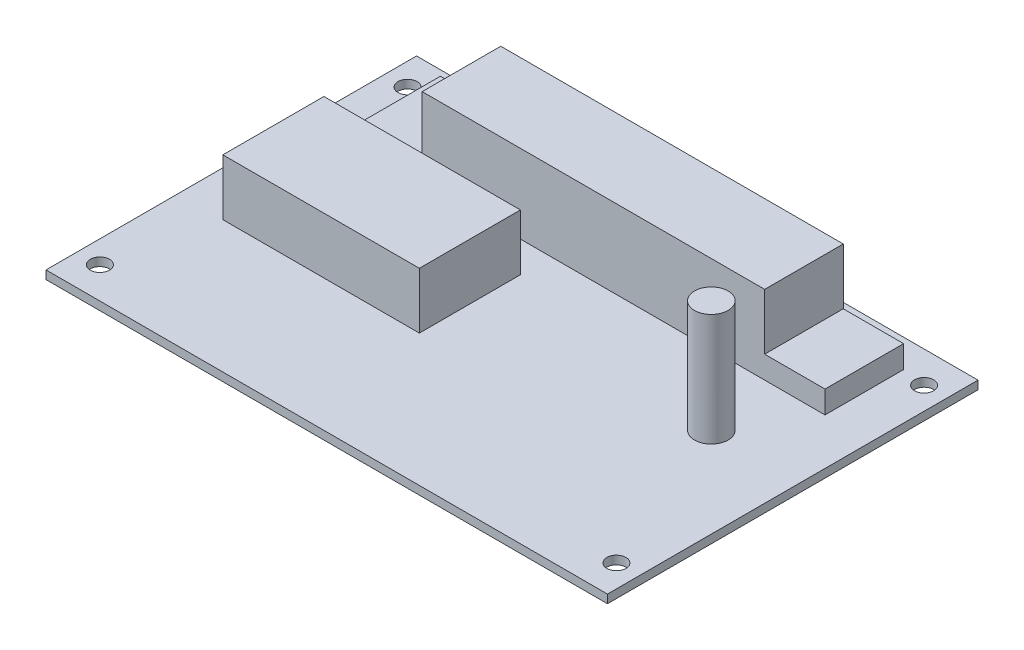
ISO-10303-21;
HEADER;
FILE_DESCRIPTION(('STEP AP214'),'2;1');
FILE_NAME('part.step','',(''),(''),'','','');
FILE_SCHEMA(('AUTOMOTIVE_DESIGN { 1 0 10303 214 1 1 1 1 }'));
ENDSEC;
DATA;
#1=APPLICATION_CONTEXT('core data for automotive mechanical design processes');
#2=APPLICATION_PROTOCOL_DEFINITION('international standard','automotive_design',2000,#1);
#3=PRODUCT_CONTEXT('',#1,'mechanical');
#4=PRODUCT('Part','Part','',(#3));
#5=PRODUCT_RELATED_PRODUCT_CATEGORY('part','',(#4));
#6=PRODUCT_DEFINITION_FORMATION('','',#4);
#7=PRODUCT_DEFINITION_CONTEXT('part definition',#1,'design');
#8=PRODUCT_DEFINITION('design','',#6,#7);
#9=PRODUCT_DEFINITION_SHAPE('','',#8);
#10=(LENGTH_UNIT() NAMED_UNIT(*) SI_UNIT(.MILLI.,.METRE.));
#11=(NAMED_UNIT(*) PLANE_ANGLE_UNIT() SI_UNIT($,.RADIAN.));
#12=(NAMED_UNIT(*) SI_UNIT($,.STERADIAN.) SOLID_ANGLE_UNIT());
#13=UNCERTAINTY_MEASURE_WITH_UNIT(LENGTH_MEASURE(1.E-05),#10,'distance_accuracy_value','');
#14=(GEOMETRIC_REPRESENTATION_CONTEXT(3) GLOBAL_UNCERTAINTY_ASSIGNED_CONTEXT((#13)) GLOBAL_UNIT_ASSIGNED_CONTEXT((#10,
#11,#12)) REPRESENTATION_CONTEXT('',''));
#15=CARTESIAN_POINT('',(0.,0.,0.));
#16=DIRECTION('',(0.,0.,1.));
#17=DIRECTION('',(1.,0.,0.));
#18=AXIS2_PLACEMENT_3D('',#15,#16,#17);
#19=CARTESIAN_POINT('',(0.,1.5,0.));
#20=DIRECTION('',(0.,-1.,0.));
#21=DIRECTION('',(0.,0.,-1.));
#22=AXIS2_PLACEMENT_3D('',#19,#20,#21);
#23=PLANE('',#22);
#24=DIRECTION('',(0.,0.,-1.));
#25=VECTOR('',#24,1.);
#26=CARTESIAN_POINT('',(41.75,1.5,-28.));
#27=LINE('',#26,#25);
#28=CARTESIAN_POINT('',(41.75,1.5,-14.));
#29=VERTEX_POINT('',#28);
#30=CARTESIAN_POINT('',(41.75,1.5,-28.));
#31=VERTEX_POINT('',#30);
#32=EDGE_CURVE('E221',#29,#31,#27,.T.);
#33=ORIENTED_EDGE('',*,*,#32,.F.);
#34=DIRECTION('',(1.,0.,0.));
#35=VECTOR('',#34,1.);
#36=CARTESIAN_POINT('',(-30.,1.5,-14.));
#37=LINE('',#36,#35);
#38=CARTESIAN_POINT('',(-40.75,1.5,-14.));
#39=VERTEX_POINT('',#38);
#40=EDGE_CURVE('E251',#39,#29,#37,.T.);
#41=ORIENTED_EDGE('',*,*,#40,.F.);
#42=DIRECTION('',(0.,0.,1.));
#43=VECTOR('',#42,1.);
#44=CARTESIAN_POINT('',(-40.75,1.5,-28.));
#45=LINE('',#44,#43);
#46=CARTESIAN_POINT('',(-40.75,1.5,-28.));
#47=VERTEX_POINT('',#46);
#48=EDGE_CURVE('E216',#47,#39,#45,.T.);
#49=ORIENTED_EDGE('',*,*,#48,.F.);
#50=DIRECTION('',(-1.,0.,0.));
#51=VECTOR('',#50,1.);
#52=CARTESIAN_POINT('',(-30.,1.5,-28.));
#53=LINE('',#52,#51);
#54=EDGE_CURVE('E257',#31,#47,#53,.T.);
#55=ORIENTED_EDGE('',*,*,#54,.F.);
#56=EDGE_LOOP('',(#33,#41,#49,#55));
#57=FACE_BOUND('',#56,.T.);
#58=DIRECTION('',(0.,0.,-1.));
#59=VECTOR('',#58,1.);
#60=CARTESIAN_POINT('',(50.,1.5,33.));
#61=LINE('',#60,#59);
#62=CARTESIAN_POINT('',(50.,1.5,33.));
#63=VERTEX_POINT('',#62);
#64=CARTESIAN_POINT('',(50.,1.5,-33.));
#65=VERTEX_POINT('',#64);
#66=EDGE_CURVE('E281',#63,#65,#61,.T.);
#67=ORIENTED_EDGE('',*,*,#66,.T.);
#68=DIRECTION('',(-1.,0.,0.));
#69=VECTOR('',#68,1.);
#70=CARTESIAN_POINT('',(-50.,1.5,-33.));
#71=LINE('',#70,#69);
#72=CARTESIAN_POINT('',(-50.,1.5,-33.));
#73=VERTEX_POINT('',#72);
#74=EDGE_CURVE('E285',#65,#73,#71,.T.);
#75=ORIENTED_EDGE('',*,*,#74,.T.);
#76=DIRECTION('',(0.,0.,1.));
#77=VECTOR('',#76,1.);
#78=CARTESIAN_POINT('',(-50.,1.5,33.));
#79=LINE('',#78,#77);
#80=CARTESIAN_POINT('',(-50.,1.5,33.));
#81=VERTEX_POINT('',#80);
#82=EDGE_CURVE('E289',#73,#81,#79,.T.);
#83=ORIENTED_EDGE('',*,*,#82,.T.);
#84=DIRECTION('',(1.,0.,0.));
#85=VECTOR('',#84,1.);
#86=CARTESIAN_POINT('',(-50.,1.5,33.));
#87=LINE('',#86,#85);
#88=EDGE_CURVE('E291',#81,#63,#87,.T.);
#89=ORIENTED_EDGE('',*,*,#88,.T.);
#90=EDGE_LOOP('',(#67,#75,#83,#89));
#91=FACE_BOUND('',#90,.T.);
#92=CARTESIAN_POINT('',(34.,1.5,-1.49999999999999));
#93=DIRECTION('',(0.,-1.,0.));
#94=DIRECTION('',(0.,0.,-1.));
#95=AXIS2_PLACEMENT_3D('',#92,#93,#94);
#96=CIRCLE('',#95,3.);
#97=CARTESIAN_POINT('',(34.,1.5,-4.5));
#98=VERTEX_POINT('',#97);
#99=EDGE_CURVE('E12',#98,#98,#96,.F.);
#100=ORIENTED_EDGE('',*,*,#99,.F.);
#101=EDGE_LOOP('',(#100));
#102=FACE_BOUND('',#101,.T.);
#103=CARTESIAN_POINT('',(46.,1.5,27.4007764277433));
#104=DIRECTION('',(0.,1.,0.));
#105=DIRECTION('',(0.,0.,1.));
#106=AXIS2_PLACEMENT_3D('',#103,#104,#105);
#107=CIRCLE('',#106,1.7);
#108=CARTESIAN_POINT('',(46.,1.5,29.1007764277433));
#109=VERTEX_POINT('',#108);
#110=EDGE_CURVE('E206',#109,#109,#107,.T.);
#111=ORIENTED_EDGE('',*,*,#110,.F.);
#112=EDGE_LOOP('',(#111));
#113=FACE_BOUND('',#112,.T.);
#114=CARTESIAN_POINT('',(46.,1.5,-27.4007764277433));
#115=DIRECTION('',(0.,1.,0.));
#116=DIRECTION('',(0.,0.,1.));
#117=AXIS2_PLACEMENT_3D('',#114,#115,#116);
#118=CIRCLE('',#117,1.7);
#119=CARTESIAN_POINT('',(46.,1.5,-25.7007764277433));
#120=VERTEX_POINT('',#119);
#121=EDGE_CURVE('E200',#120,#120,#118,.T.);
#122=ORIENTED_EDGE('',*,*,#121,.F.);
#123=EDGE_LOOP('',(#122));
#124=FACE_BOUND('',#123,.T.);
#125=CARTESIAN_POINT('',(-46.,1.5,-27.4007764277433));
#126=DIRECTION('',(0.,1.,0.));
#127=DIRECTION('',(0.,0.,1.));
#128=AXIS2_PLACEMENT_3D('',#125,#126,#127);
#129=CIRCLE('',#128,1.7);
#130=CARTESIAN_POINT('',(-46.,1.5,-25.7007764277433));
#131=VERTEX_POINT('',#130);
#132=EDGE_CURVE('E194',#131,#131,#129,.T.);
#133=ORIENTED_EDGE('',*,*,#132,.F.);
#134=EDGE_LOOP('',(#133));
#135=FACE_BOUND('',#134,.T.);
#136=CARTESIAN_POINT('',(-46.,1.5,27.4007764277433));
#137=DIRECTION('',(0.,1.,0.));
#138=DIRECTION('',(0.,0.,1.));
#139=AXIS2_PLACEMENT_3D('',#136,#137,#138);
#140=CIRCLE('',#139,1.7);
#141=CARTESIAN_POINT('',(-46.,1.5,29.1007764277433));
#142=VERTEX_POINT('',#141);
#143=EDGE_CURVE('E183',#142,#142,#140,.T.);
#144=ORIENTED_EDGE('',*,*,#143,.F.);
#145=EDGE_LOOP('',(#144));
#146=FACE_BOUND('',#145,.T.);
#147=DIRECTION('',(0.,0.,1.));
#148=VECTOR('',#147,1.);
#149=CARTESIAN_POINT('',(-42.,1.5,-8.49999999999999));
#150=LINE('',#149,#148);
#151=CARTESIAN_POINT('',(-42.,1.5,-8.49999999999999));
#152=VERTEX_POINT('',#151);
#153=CARTESIAN_POINT('',(-42.,1.5,9.50000000000001));
#154=VERTEX_POINT('',#153);
#155=EDGE_CURVE('E182',#152,#154,#150,.T.);
#156=ORIENTED_EDGE('',*,*,#155,.F.);
#157=DIRECTION('',(-1.,0.,0.));
#158=VECTOR('',#157,1.);
#159=CARTESIAN_POINT('',(-42.,1.5,-8.49999999999999));
#160=LINE('',#159,#158);
#161=CARTESIAN_POINT('',(-7.00000000000001,1.5,-8.49999999999999));
#162=VERTEX_POINT('',#161);
#163=EDGE_CURVE('E179',#162,#152,#160,.T.);
#164=ORIENTED_EDGE('',*,*,#163,.F.);
#165=DIRECTION('',(0.,0.,-1.));
#166=VECTOR('',#165,1.);
#167=CARTESIAN_POINT('',(-7.00000000000001,1.5,-8.49999999999999));
#168=LINE('',#167,#166);
#169=CARTESIAN_POINT('',(-7.00000000000001,1.5,9.50000000000001));
#170=VERTEX_POINT('',#169);
#171=EDGE_CURVE('E66',#170,#162,#168,.T.);
#172=ORIENTED_EDGE('',*,*,#171,.F.);
#173=DIRECTION('',(1.,0.,0.));
#174=VECTOR('',#173,1.);
#175=CARTESIAN_POINT('',(-42.,1.5,9.50000000000001));
#176=LINE('',#175,#174);
#177=EDGE_CURVE('E61',#154,#170,#176,.T.);
#178=ORIENTED_EDGE('',*,*,#177,.F.);
#179=EDGE_LOOP('',(#156,#164,#172,#178));
#180=FACE_BOUND('',#179,.T.);
#181=ADVANCED_FACE('F45',(#57,#91,#102,#113,#124,#135,#146,#180),#23,.F.);
#182=CARTESIAN_POINT('',(50.,1.5,33.));
#183=DIRECTION('',(-1.,0.,0.));
#184=DIRECTION('',(0.,0.,1.));
#185=AXIS2_PLACEMENT_3D('',#182,#183,#184);
#186=PLANE('',#185);
#187=DIRECTION('',(0.,0.,-1.));
#188=VECTOR('',#187,1.);
#189=CARTESIAN_POINT('',(50.,0.,33.));
#190=LINE('',#189,#188);
#191=CARTESIAN_POINT('',(50.,0.,33.));
#192=VERTEX_POINT('',#191);
#193=CARTESIAN_POINT('',(50.,0.,-33.));
#194=VERTEX_POINT('',#193);
#195=EDGE_CURVE('E280',#192,#194,#190,.T.);
#196=ORIENTED_EDGE('',*,*,#195,.T.);
#197=DIRECTION('',(0.,-1.,0.));
#198=VECTOR('',#197,1.);
#199=CARTESIAN_POINT('',(50.,1.5,-33.));
#200=LINE('',#199,#198);
#201=EDGE_CURVE('E54',#65,#194,#200,.T.);
#202=ORIENTED_EDGE('',*,*,#201,.F.);
#203=ORIENTED_EDGE('',*,*,#66,.F.);
#204=DIRECTION('',(0.,-1.,0.));
#205=VECTOR('',#204,1.);
#206=CARTESIAN_POINT('',(50.,1.5,33.));
#207=LINE('',#206,#205);
#208=EDGE_CURVE('E293',#63,#192,#207,.T.);
#209=ORIENTED_EDGE('',*,*,#208,.T.);
#210=EDGE_LOOP('',(#196,#202,#203,#209));
#211=FACE_BOUND('',#210,.T.);
#212=ADVANCED_FACE('F47',(#211),#186,.F.);
#213=CARTESIAN_POINT('',(-50.,1.5,-33.));
#214=DIRECTION('',(0.,0.,1.));
#215=DIRECTION('',(1.,0.,0.));
#216=AXIS2_PLACEMENT_3D('',#213,#214,#215);
#217=PLANE('',#216);
#218=DIRECTION('',(-1.,0.,0.));
#219=VECTOR('',#218,1.);
#220=CARTESIAN_POINT('',(-50.,0.,-33.));
#221=LINE('',#220,#219);
#222=CARTESIAN_POINT('',(-50.,0.,-33.));
#223=VERTEX_POINT('',#222);
#224=EDGE_CURVE('E297',#194,#223,#221,.T.);
#225=ORIENTED_EDGE('',*,*,#224,.T.);
#226=DIRECTION('',(0.,-1.,0.));
#227=VECTOR('',#226,1.);
#228=CARTESIAN_POINT('',(-50.,1.5,-33.));
#229=LINE('',#228,#227);
#230=EDGE_CURVE('E308',#73,#223,#229,.T.);
#231=ORIENTED_EDGE('',*,*,#230,.F.);
#232=ORIENTED_EDGE('',*,*,#74,.F.);
#233=ORIENTED_EDGE('',*,*,#201,.T.);
#234=EDGE_LOOP('',(#225,#231,#232,#233));
#235=FACE_BOUND('',#234,.T.);
#236=ADVANCED_FACE('F313',(#235),#217,.F.);
#237=CARTESIAN_POINT('',(-50.,1.5,33.));
#238=DIRECTION('',(1.,0.,0.));
#239=DIRECTION('',(0.,0.,-1.));
#240=AXIS2_PLACEMENT_3D('',#237,#238,#239);
#241=PLANE('',#240);
#242=DIRECTION('',(0.,0.,1.));
#243=VECTOR('',#242,1.);
#244=CARTESIAN_POINT('',(-50.,0.,33.));
#245=LINE('',#244,#243);
#246=CARTESIAN_POINT('',(-50.,0.,33.));
#247=VERTEX_POINT('',#246);
#248=EDGE_CURVE('E300',#223,#247,#245,.T.);
#249=ORIENTED_EDGE('',*,*,#248,.T.);
#250=DIRECTION('',(0.,-1.,0.));
#251=VECTOR('',#250,1.);
#252=CARTESIAN_POINT('',(-50.,1.5,33.));
#253=LINE('',#252,#251);
#254=EDGE_CURVE('E305',#81,#247,#253,.T.);
#255=ORIENTED_EDGE('',*,*,#254,.F.);
#256=ORIENTED_EDGE('',*,*,#82,.F.);
#257=ORIENTED_EDGE('',*,*,#230,.T.);
#258=EDGE_LOOP('',(#249,#255,#256,#257));
#259=FACE_BOUND('',#258,.T.);
#260=ADVANCED_FACE('F325',(#259),#241,.F.);
#261=CARTESIAN_POINT('',(-50.,1.5,33.));
#262=DIRECTION('',(0.,0.,-1.));
#263=DIRECTION('',(-1.,0.,0.));
#264=AXIS2_PLACEMENT_3D('',#261,#262,#263);
#265=PLANE('',#264);
#266=DIRECTION('',(1.,0.,0.));
#267=VECTOR('',#266,1.);
#268=CARTESIAN_POINT('',(-50.,0.,33.));
#269=LINE('',#268,#267);
#270=EDGE_CURVE('E286',#247,#192,#269,.T.);
#271=ORIENTED_EDGE('',*,*,#270,.T.);
#272=ORIENTED_EDGE('',*,*,#208,.F.);
#273=ORIENTED_EDGE('',*,*,#88,.F.);
#274=ORIENTED_EDGE('',*,*,#254,.T.);
#275=EDGE_LOOP('',(#271,#272,#273,#274));
#276=FACE_BOUND('',#275,.T.);
#277=ADVANCED_FACE('F329',(#276),#265,.F.);
#278=CARTESIAN_POINT('',(0.,0.,0.));
#279=DIRECTION('',(0.,-1.,0.));
#280=DIRECTION('',(0.,0.,-1.));
#281=AXIS2_PLACEMENT_3D('',#278,#279,#280);
#282=PLANE('',#281);
#283=CARTESIAN_POINT('',(-46.,0.,27.4007764277433));
#284=DIRECTION('',(0.,1.,0.));
#285=DIRECTION('',(0.,0.,1.));
#286=AXIS2_PLACEMENT_3D('',#283,#284,#285);
#287=CIRCLE('',#286,1.7);
#288=CARTESIAN_POINT('',(-46.,0.,29.1007764277433));
#289=VERTEX_POINT('',#288);
#290=EDGE_CURVE('E186',#289,#289,#287,.T.);
#291=ORIENTED_EDGE('',*,*,#290,.T.);
#292=EDGE_LOOP('',(#291));
#293=FACE_BOUND('',#292,.T.);
#294=CARTESIAN_POINT('',(-46.,0.,-27.4007764277433));
#295=DIRECTION('',(0.,1.,0.));
#296=DIRECTION('',(0.,0.,1.));
#297=AXIS2_PLACEMENT_3D('',#294,#295,#296);
#298=CIRCLE('',#297,1.7);
#299=CARTESIAN_POINT('',(-46.,0.,-25.7007764277433));
#300=VERTEX_POINT('',#299);
#301=EDGE_CURVE('E197',#300,#300,#298,.T.);
#302=ORIENTED_EDGE('',*,*,#301,.T.);
#303=EDGE_LOOP('',(#302));
#304=FACE_BOUND('',#303,.T.);
#305=CARTESIAN_POINT('',(46.,0.,-27.4007764277433));
#306=DIRECTION('',(0.,1.,0.));
#307=DIRECTION('',(0.,0.,1.));
#308=AXIS2_PLACEMENT_3D('',#305,#306,#307);
#309=CIRCLE('',#308,1.7);
#310=CARTESIAN_POINT('',(46.,0.,-25.7007764277433));
#311=VERTEX_POINT('',#310);
#312=EDGE_CURVE('E203',#311,#311,#309,.T.);
#313=ORIENTED_EDGE('',*,*,#312,.T.);
#314=EDGE_LOOP('',(#313));
#315=FACE_BOUND('',#314,.T.);
#316=CARTESIAN_POINT('',(46.,0.,27.4007764277433));
#317=DIRECTION('',(0.,1.,0.));
#318=DIRECTION('',(0.,0.,1.));
#319=AXIS2_PLACEMENT_3D('',#316,#317,#318);
#320=CIRCLE('',#319,1.7);
#321=CARTESIAN_POINT('',(46.,0.,29.1007764277433));
#322=VERTEX_POINT('',#321);
#323=EDGE_CURVE('E209',#322,#322,#320,.T.);
#324=ORIENTED_EDGE('',*,*,#323,.T.);
#325=EDGE_LOOP('',(#324));
#326=FACE_BOUND('',#325,.T.);
#327=ORIENTED_EDGE('',*,*,#195,.F.);
#328=ORIENTED_EDGE('',*,*,#270,.F.);
#329=ORIENTED_EDGE('',*,*,#248,.F.);
#330=ORIENTED_EDGE('',*,*,#224,.F.);
#331=EDGE_LOOP('',(#327,#328,#329,#330));
#332=FACE_BOUND('',#331,.T.);
#333=ADVANCED_FACE('F321',(#293,#304,#315,#326,#332),#282,.T.);
#334=CARTESIAN_POINT('',(-30.,15.5,-28.));
#335=DIRECTION('',(1.,0.,0.));
#336=DIRECTION('',(0.,0.,-1.));
#337=AXIS2_PLACEMENT_3D('',#334,#335,#336);
#338=PLANE('',#337);
#339=DIRECTION('',(0.,-1.,0.));
#340=VECTOR('',#339,1.);
#341=CARTESIAN_POINT('',(-30.,15.5,-28.));
#342=LINE('',#341,#340);
#343=CARTESIAN_POINT('',(-30.,15.5,-28.));
#344=VERTEX_POINT('',#343);
#345=CARTESIAN_POINT('',(-30.,5.5,-28.));
#346=VERTEX_POINT('',#345);
#347=EDGE_CURVE('E264',#344,#346,#342,.T.);
#348=ORIENTED_EDGE('',*,*,#347,.T.);
#349=DIRECTION('',(0.,0.,1.));
#350=VECTOR('',#349,1.);
#351=CARTESIAN_POINT('',(-30.,5.5,-28.));
#352=LINE('',#351,#350);
#353=CARTESIAN_POINT('',(-30.,5.5,-14.));
#354=VERTEX_POINT('',#353);
#355=EDGE_CURVE('E248',#346,#354,#352,.T.);
#356=ORIENTED_EDGE('',*,*,#355,.T.);
#357=DIRECTION('',(0.,-1.,0.));
#358=VECTOR('',#357,1.);
#359=CARTESIAN_POINT('',(-30.,15.5,-14.));
#360=LINE('',#359,#358);
#361=CARTESIAN_POINT('',(-30.,15.5,-14.));
#362=VERTEX_POINT('',#361);
#363=EDGE_CURVE('E276',#362,#354,#360,.T.);
#364=ORIENTED_EDGE('',*,*,#363,.F.);
#365=DIRECTION('',(0.,0.,1.));
#366=VECTOR('',#365,1.);
#367=CARTESIAN_POINT('',(-30.,15.5,-28.));
#368=LINE('',#367,#366);
#369=EDGE_CURVE('E252',#344,#362,#368,.T.);
#370=ORIENTED_EDGE('',*,*,#369,.F.);
#371=EDGE_LOOP('',(#348,#356,#364,#370));
#372=FACE_BOUND('',#371,.T.);
#373=ADVANCED_FACE('F427',(#372),#338,.F.);
#374=CARTESIAN_POINT('',(-30.,15.5,-14.));
#375=DIRECTION('',(0.,0.,-1.));
#376=DIRECTION('',(-1.,0.,0.));
#377=AXIS2_PLACEMENT_3D('',#374,#375,#376);
#378=PLANE('',#377);
#379=ORIENTED_EDGE('',*,*,#363,.T.);
#380=DIRECTION('',(1.,0.,0.));
#381=VECTOR('',#380,1.);
#382=CARTESIAN_POINT('',(-40.75,5.5,-14.));
#383=LINE('',#382,#381);
#384=CARTESIAN_POINT('',(-40.75,5.5,-14.));
#385=VERTEX_POINT('',#384);
#386=EDGE_CURVE('E222',#385,#354,#383,.T.);
#387=ORIENTED_EDGE('',*,*,#386,.F.);
#388=DIRECTION('',(0.,-1.,0.));
#389=VECTOR('',#388,1.);
#390=CARTESIAN_POINT('',(-40.75,5.5,-14.));
#391=LINE('',#390,#389);
#392=EDGE_CURVE('E242',#385,#39,#391,.T.);
#393=ORIENTED_EDGE('',*,*,#392,.T.);
#394=ORIENTED_EDGE('',*,*,#40,.T.);
#395=DIRECTION('',(0.,-1.,0.));
#396=VECTOR('',#395,1.);
#397=CARTESIAN_POINT('',(41.75,5.5,-14.));
#398=LINE('',#397,#396);
#399=CARTESIAN_POINT('',(41.75,5.5,-14.));
#400=VERTEX_POINT('',#399);
#401=EDGE_CURVE('E239',#400,#29,#398,.T.);
#402=ORIENTED_EDGE('',*,*,#401,.F.);
#403=CARTESIAN_POINT('',(31.,5.5,-14.));
#404=VERTEX_POINT('',#403);
#405=EDGE_CURVE('E220',#404,#400,#383,.T.);
#406=ORIENTED_EDGE('',*,*,#405,.F.);
#407=DIRECTION('',(0.,-1.,0.));
#408=VECTOR('',#407,1.);
#409=CARTESIAN_POINT('',(31.,15.5,-14.));
#410=LINE('',#409,#408);
#411=CARTESIAN_POINT('',(31.,15.5,-14.));
#412=VERTEX_POINT('',#411);
#413=EDGE_CURVE('E272',#412,#404,#410,.T.);
#414=ORIENTED_EDGE('',*,*,#413,.F.);
#415=DIRECTION('',(1.,0.,0.));
#416=VECTOR('',#415,1.);
#417=CARTESIAN_POINT('',(-30.,15.5,-14.));
#418=LINE('',#417,#416);
#419=EDGE_CURVE('E256',#362,#412,#418,.T.);
#420=ORIENTED_EDGE('',*,*,#419,.F.);
#421=EDGE_LOOP('',(#379,#387,#393,#394,#402,#406,#414,#420));
#422=FACE_BOUND('',#421,.T.);
#423=ADVANCED_FACE('F423',(#422),#378,.F.);
#424=CARTESIAN_POINT('',(31.,15.5,-28.));
#425=DIRECTION('',(-1.,0.,0.));
#426=DIRECTION('',(0.,0.,1.));
#427=AXIS2_PLACEMENT_3D('',#424,#425,#426);
#428=PLANE('',#427);
#429=ORIENTED_EDGE('',*,*,#413,.T.);
#430=DIRECTION('',(0.,0.,-1.));
#431=VECTOR('',#430,1.);
#432=CARTESIAN_POINT('',(31.,5.5,-28.));
#433=LINE('',#432,#431);
#434=CARTESIAN_POINT('',(31.,5.5,-28.));
#435=VERTEX_POINT('',#434);
#436=EDGE_CURVE('E245',#404,#435,#433,.T.);
#437=ORIENTED_EDGE('',*,*,#436,.T.);
#438=DIRECTION('',(0.,-1.,0.));
#439=VECTOR('',#438,1.);
#440=CARTESIAN_POINT('',(31.,15.5,-28.));
#441=LINE('',#440,#439);
#442=CARTESIAN_POINT('',(31.,15.5,-28.));
#443=VERTEX_POINT('',#442);
#444=EDGE_CURVE('E269',#443,#435,#441,.T.);
#445=ORIENTED_EDGE('',*,*,#444,.F.);
#446=DIRECTION('',(0.,0.,-1.));
#447=VECTOR('',#446,1.);
#448=CARTESIAN_POINT('',(31.,15.5,-28.));
#449=LINE('',#448,#447);
#450=EDGE_CURVE('E260',#412,#443,#449,.T.);
#451=ORIENTED_EDGE('',*,*,#450,.F.);
#452=EDGE_LOOP('',(#429,#437,#445,#451));
#453=FACE_BOUND('',#452,.T.);
#454=ADVANCED_FACE('F419',(#453),#428,.F.);
#455=CARTESIAN_POINT('',(-30.,15.5,-28.));
#456=DIRECTION('',(0.,0.,1.));
#457=DIRECTION('',(1.,0.,0.));
#458=AXIS2_PLACEMENT_3D('',#455,#456,#457);
#459=PLANE('',#458);
#460=ORIENTED_EDGE('',*,*,#444,.T.);
#461=DIRECTION('',(-1.,0.,0.));
#462=VECTOR('',#461,1.);
#463=CARTESIAN_POINT('',(-40.75,5.5,-28.));
#464=LINE('',#463,#462);
#465=CARTESIAN_POINT('',(41.75,5.5,-28.));
#466=VERTEX_POINT('',#465);
#467=EDGE_CURVE('E227',#466,#435,#464,.T.);
#468=ORIENTED_EDGE('',*,*,#467,.F.);
#469=DIRECTION('',(0.,-1.,0.));
#470=VECTOR('',#469,1.);
#471=CARTESIAN_POINT('',(41.75,5.5,-28.));
#472=LINE('',#471,#470);
#473=EDGE_CURVE('E236',#466,#31,#472,.T.);
#474=ORIENTED_EDGE('',*,*,#473,.T.);
#475=ORIENTED_EDGE('',*,*,#54,.T.);
#476=DIRECTION('',(0.,-1.,0.));
#477=VECTOR('',#476,1.);
#478=CARTESIAN_POINT('',(-40.75,5.5,-28.));
#479=LINE('',#478,#477);
#480=CARTESIAN_POINT('',(-40.75,5.5,-28.));
#481=VERTEX_POINT('',#480);
#482=EDGE_CURVE('E229',#481,#47,#479,.T.);
#483=ORIENTED_EDGE('',*,*,#482,.F.);
#484=EDGE_CURVE('E226',#346,#481,#464,.T.);
#485=ORIENTED_EDGE('',*,*,#484,.F.);
#486=ORIENTED_EDGE('',*,*,#347,.F.);
#487=DIRECTION('',(-1.,0.,0.));
#488=VECTOR('',#487,1.);
#489=CARTESIAN_POINT('',(-30.,15.5,-28.));
#490=LINE('',#489,#488);
#491=EDGE_CURVE('E262',#443,#344,#490,.T.);
#492=ORIENTED_EDGE('',*,*,#491,.F.);
#493=EDGE_LOOP('',(#460,#468,#474,#475,#483,#485,#486,#492));
#494=FACE_BOUND('',#493,.T.);
#495=ADVANCED_FACE('F415',(#494),#459,.F.);
#496=CARTESIAN_POINT('',(0.,15.5,0.));
#497=DIRECTION('',(0.,1.,0.));
#498=DIRECTION('',(0.,0.,1.));
#499=AXIS2_PLACEMENT_3D('',#496,#497,#498);
#500=PLANE('',#499);
#501=ORIENTED_EDGE('',*,*,#369,.T.);
#502=ORIENTED_EDGE('',*,*,#419,.T.);
#503=ORIENTED_EDGE('',*,*,#450,.T.);
#504=ORIENTED_EDGE('',*,*,#491,.T.);
#505=EDGE_LOOP('',(#501,#502,#503,#504));
#506=FACE_BOUND('',#505,.T.);
#507=ADVANCED_FACE('F412',(#506),#500,.T.);
#508=CARTESIAN_POINT('',(0.,5.5,0.));
#509=DIRECTION('',(0.,1.,0.));
#510=DIRECTION('',(0.,0.,1.));
#511=AXIS2_PLACEMENT_3D('',#508,#509,#510);
#512=PLANE('',#511);
#513=ORIENTED_EDGE('',*,*,#436,.F.);
#514=ORIENTED_EDGE('',*,*,#405,.T.);
#515=DIRECTION('',(0.,0.,-1.));
#516=VECTOR('',#515,1.);
#517=CARTESIAN_POINT('',(41.75,5.5,-28.));
#518=LINE('',#517,#516);
#519=EDGE_CURVE('E224',#400,#466,#518,.T.);
#520=ORIENTED_EDGE('',*,*,#519,.T.);
#521=ORIENTED_EDGE('',*,*,#467,.T.);
#522=EDGE_LOOP('',(#513,#514,#520,#521));
#523=FACE_BOUND('',#522,.T.);
#524=ADVANCED_FACE('F405',(#523),#512,.T.);
#525=CARTESIAN_POINT('',(41.75,5.5,-28.));
#526=DIRECTION('',(-1.,0.,0.));
#527=DIRECTION('',(0.,0.,1.));
#528=AXIS2_PLACEMENT_3D('',#525,#526,#527);
#529=PLANE('',#528);
#530=ORIENTED_EDGE('',*,*,#32,.T.);
#531=ORIENTED_EDGE('',*,*,#473,.F.);
#532=ORIENTED_EDGE('',*,*,#519,.F.);
#533=ORIENTED_EDGE('',*,*,#401,.T.);
#534=EDGE_LOOP('',(#530,#531,#532,#533));
#535=FACE_BOUND('',#534,.T.);
#536=ADVANCED_FACE('F403',(#535),#529,.F.);
#537=ORIENTED_EDGE('',*,*,#355,.F.);
#538=ORIENTED_EDGE('',*,*,#484,.T.);
#539=DIRECTION('',(0.,0.,1.));
#540=VECTOR('',#539,1.);
#541=CARTESIAN_POINT('',(-40.75,5.5,-28.));
#542=LINE('',#541,#540);
#543=EDGE_CURVE('E217',#481,#385,#542,.T.);
#544=ORIENTED_EDGE('',*,*,#543,.T.);
#545=ORIENTED_EDGE('',*,*,#386,.T.);
#546=EDGE_LOOP('',(#537,#538,#544,#545));
#547=FACE_BOUND('',#546,.T.);
#548=ADVANCED_FACE('F400',(#547),#512,.T.);
#549=CARTESIAN_POINT('',(-40.75,5.5,-28.));
#550=DIRECTION('',(1.,0.,0.));
#551=DIRECTION('',(0.,0.,-1.));
#552=AXIS2_PLACEMENT_3D('',#549,#550,#551);
#553=PLANE('',#552);
#554=ORIENTED_EDGE('',*,*,#48,.T.);
#555=ORIENTED_EDGE('',*,*,#392,.F.);
#556=ORIENTED_EDGE('',*,*,#543,.F.);
#557=ORIENTED_EDGE('',*,*,#482,.T.);
#558=EDGE_LOOP('',(#554,#555,#556,#557));
#559=FACE_BOUND('',#558,.T.);
#560=ADVANCED_FACE('F398',(#559),#553,.F.);
#561=CARTESIAN_POINT('',(34.,21.5,-1.49999999999999));
#562=DIRECTION('',(0.,-1.,0.));
#563=DIRECTION('',(0.,0.,-1.));
#564=AXIS2_PLACEMENT_3D('',#561,#562,#563);
#565=CYLINDRICAL_SURFACE('',#564,3.);
#566=CARTESIAN_POINT('',(34.,21.5,-1.49999999999999));
#567=DIRECTION('',(0.,1.,0.));
#568=DIRECTION('',(0.,0.,1.));
#569=AXIS2_PLACEMENT_3D('',#566,#567,#568);
#570=CIRCLE('',#569,3.);
#571=CARTESIAN_POINT('',(34.,21.5,1.50000000000001));
#572=VERTEX_POINT('',#571);
#573=EDGE_CURVE('E212',#572,#572,#570,.T.);
#574=ORIENTED_EDGE('',*,*,#573,.F.);
#575=EDGE_LOOP('',(#574));
#576=FACE_BOUND('',#575,.T.);
#577=ORIENTED_EDGE('',*,*,#99,.T.);
#578=EDGE_LOOP('',(#577));
#579=FACE_BOUND('',#578,.T.);
#580=ADVANCED_FACE('F394',(#576,#579),#565,.T.);
#581=CARTESIAN_POINT('',(34.,21.5,-1.49999999999999));
#582=DIRECTION('',(0.,1.,0.));
#583=DIRECTION('',(0.,0.,1.));
#584=AXIS2_PLACEMENT_3D('',#581,#582,#583);
#585=PLANE('',#584);
#586=ORIENTED_EDGE('',*,*,#573,.T.);
#587=EDGE_LOOP('',(#586));
#588=FACE_BOUND('',#587,.T.);
#589=ADVANCED_FACE('F390',(#588),#585,.T.);
#590=CARTESIAN_POINT('',(46.,1.5,27.4007764277433));
#591=DIRECTION('',(0.,1.,0.));
#592=DIRECTION('',(0.,0.,1.));
#593=AXIS2_PLACEMENT_3D('',#590,#591,#592);
#594=CYLINDRICAL_SURFACE('',#593,1.7);
#595=ORIENTED_EDGE('',*,*,#323,.F.);
#596=EDGE_LOOP('',(#595));
#597=FACE_BOUND('',#596,.T.);
#598=ORIENTED_EDGE('',*,*,#110,.T.);
#599=EDGE_LOOP('',(#598));
#600=FACE_BOUND('',#599,.T.);
#601=ADVANCED_FACE('F386',(#597,#600),#594,.F.);
#602=CARTESIAN_POINT('',(46.,1.5,-27.4007764277433));
#603=DIRECTION('',(0.,1.,0.));
#604=DIRECTION('',(0.,0.,1.));
#605=AXIS2_PLACEMENT_3D('',#602,#603,#604);
#606=CYLINDRICAL_SURFACE('',#605,1.7);
#607=ORIENTED_EDGE('',*,*,#312,.F.);
#608=EDGE_LOOP('',(#607));
#609=FACE_BOUND('',#608,.T.);
#610=ORIENTED_EDGE('',*,*,#121,.T.);
#611=EDGE_LOOP('',(#610));
#612=FACE_BOUND('',#611,.T.);
#613=ADVANCED_FACE('F382',(#609,#612),#606,.F.);
#614=CARTESIAN_POINT('',(-46.,1.5,-27.4007764277433));
#615=DIRECTION('',(0.,1.,0.));
#616=DIRECTION('',(0.,0.,1.));
#617=AXIS2_PLACEMENT_3D('',#614,#615,#616);
#618=CYLINDRICAL_SURFACE('',#617,1.7);
#619=ORIENTED_EDGE('',*,*,#301,.F.);
#620=EDGE_LOOP('',(#619));
#621=FACE_BOUND('',#620,.T.);
#622=ORIENTED_EDGE('',*,*,#132,.T.);
#623=EDGE_LOOP('',(#622));
#624=FACE_BOUND('',#623,.T.);
#625=ADVANCED_FACE('F378',(#621,#624),#618,.F.);
#626=CARTESIAN_POINT('',(-46.,1.5,27.4007764277433));
#627=DIRECTION('',(0.,1.,0.));
#628=DIRECTION('',(0.,0.,1.));
#629=AXIS2_PLACEMENT_3D('',#626,#627,#628);
#630=CYLINDRICAL_SURFACE('',#629,1.7);
#631=ORIENTED_EDGE('',*,*,#290,.F.);
#632=EDGE_LOOP('',(#631));
#633=FACE_BOUND('',#632,.T.);
#634=ORIENTED_EDGE('',*,*,#143,.T.);
#635=EDGE_LOOP('',(#634));
#636=FACE_BOUND('',#635,.T.);
#637=ADVANCED_FACE('F375',(#633,#636),#630,.F.);
#638=CARTESIAN_POINT('',(-42.,11.5,-8.49999999999999));
#639=DIRECTION('',(1.,0.,0.));
#640=DIRECTION('',(0.,0.,-1.));
#641=AXIS2_PLACEMENT_3D('',#638,#639,#640);
#642=PLANE('',#641);
#643=ORIENTED_EDGE('',*,*,#155,.T.);
#644=DIRECTION('',(0.,-1.,0.));
#645=VECTOR('',#644,1.);
#646=CARTESIAN_POINT('',(-42.,11.5,9.50000000000001));
#647=LINE('',#646,#645);
#648=CARTESIAN_POINT('',(-42.,11.5,9.50000000000001));
#649=VERTEX_POINT('',#648);
#650=EDGE_CURVE('E162',#649,#154,#647,.T.);
#651=ORIENTED_EDGE('',*,*,#650,.F.);
#652=DIRECTION('',(0.,0.,1.));
#653=VECTOR('',#652,1.);
#654=CARTESIAN_POINT('',(-42.,11.5,-8.49999999999999));
#655=LINE('',#654,#653);
#656=CARTESIAN_POINT('',(-42.,11.5,-8.49999999999999));
#657=VERTEX_POINT('',#656);
#658=EDGE_CURVE('E169',#657,#649,#655,.T.);
#659=ORIENTED_EDGE('',*,*,#658,.F.);
#660=DIRECTION('',(0.,-1.,0.));
#661=VECTOR('',#660,1.);
#662=CARTESIAN_POINT('',(-42.,11.5,-8.49999999999999));
#663=LINE('',#662,#661);
#664=EDGE_CURVE('E349',#657,#152,#663,.T.);
#665=ORIENTED_EDGE('',*,*,#664,.T.);
#666=EDGE_LOOP('',(#643,#651,#659,#665));
#667=FACE_BOUND('',#666,.T.);
#668=ADVANCED_FACE('F181',(#667),#642,.F.);
#669=CARTESIAN_POINT('',(-42.,11.5,9.50000000000001));
#670=DIRECTION('',(0.,0.,-1.));
#671=DIRECTION('',(-1.,0.,0.));
#672=AXIS2_PLACEMENT_3D('',#669,#670,#671);
#673=PLANE('',#672);
#674=ORIENTED_EDGE('',*,*,#177,.T.);
#675=DIRECTION('',(0.,-1.,0.));
#676=VECTOR('',#675,1.);
#677=CARTESIAN_POINT('',(-7.00000000000001,11.5,9.50000000000001));
#678=LINE('',#677,#676);
#679=CARTESIAN_POINT('',(-7.00000000000001,11.5,9.50000000000001));
#680=VERTEX_POINT('',#679);
#681=EDGE_CURVE('E165',#680,#170,#678,.T.);
#682=ORIENTED_EDGE('',*,*,#681,.F.);
#683=DIRECTION('',(1.,0.,0.));
#684=VECTOR('',#683,1.);
#685=CARTESIAN_POINT('',(-42.,11.5,9.50000000000001));
#686=LINE('',#685,#684);
#687=EDGE_CURVE('E158',#649,#680,#686,.T.);
#688=ORIENTED_EDGE('',*,*,#687,.F.);
#689=ORIENTED_EDGE('',*,*,#650,.T.);
#690=EDGE_LOOP('',(#674,#682,#688,#689));
#691=FACE_BOUND('',#690,.T.);
#692=ADVANCED_FACE('F160',(#691),#673,.F.);
#693=CARTESIAN_POINT('',(-7.00000000000001,11.5,-8.49999999999999));
#694=DIRECTION('',(-1.,0.,0.));
#695=DIRECTION('',(0.,0.,1.));
#696=AXIS2_PLACEMENT_3D('',#693,#694,#695);
#697=PLANE('',#696);
#698=ORIENTED_EDGE('',*,*,#171,.T.);
#699=DIRECTION('',(0.,-1.,0.));
#700=VECTOR('',#699,1.);
#701=CARTESIAN_POINT('',(-7.00000000000001,11.5,-8.49999999999999));
#702=LINE('',#701,#700);
#703=CARTESIAN_POINT('',(-7.00000000000001,11.5,-8.49999999999999));
#704=VERTEX_POINT('',#703);
#705=EDGE_CURVE('E188',#704,#162,#702,.T.);
#706=ORIENTED_EDGE('',*,*,#705,.F.);
#707=DIRECTION('',(0.,0.,-1.));
#708=VECTOR('',#707,1.);
#709=CARTESIAN_POINT('',(-7.00000000000001,11.5,-8.49999999999999));
#710=LINE('',#709,#708);
#711=EDGE_CURVE('E168',#680,#704,#710,.T.);
#712=ORIENTED_EDGE('',*,*,#711,.F.);
#713=ORIENTED_EDGE('',*,*,#681,.T.);
#714=EDGE_LOOP('',(#698,#706,#712,#713));
#715=FACE_BOUND('',#714,.T.);
#716=ADVANCED_FACE('F362',(#715),#697,.F.);
#717=CARTESIAN_POINT('',(-42.,11.5,-8.49999999999999));
#718=DIRECTION('',(0.,0.,1.));
#719=DIRECTION('',(1.,0.,0.));
#720=AXIS2_PLACEMENT_3D('',#717,#718,#719);
#721=PLANE('',#720);
#722=ORIENTED_EDGE('',*,*,#163,.T.);
#723=ORIENTED_EDGE('',*,*,#664,.F.);
#724=DIRECTION('',(-1.,0.,0.));
#725=VECTOR('',#724,1.);
#726=CARTESIAN_POINT('',(-42.,11.5,-8.49999999999999));
#727=LINE('',#726,#725);
#728=EDGE_CURVE('E174',#704,#657,#727,.T.);
#729=ORIENTED_EDGE('',*,*,#728,.F.);
#730=ORIENTED_EDGE('',*,*,#705,.T.);
#731=EDGE_LOOP('',(#722,#723,#729,#730));
#732=FACE_BOUND('',#731,.T.);
#733=ADVANCED_FACE('F348',(#732),#721,.F.);
#734=CARTESIAN_POINT('',(0.,11.5,0.));
#735=DIRECTION('',(0.,1.,0.));
#736=DIRECTION('',(0.,0.,1.));
#737=AXIS2_PLACEMENT_3D('',#734,#735,#736);
#738=PLANE('',#737);
#739=ORIENTED_EDGE('',*,*,#658,.T.);
#740=ORIENTED_EDGE('',*,*,#687,.T.);
#741=ORIENTED_EDGE('',*,*,#711,.T.);
#742=ORIENTED_EDGE('',*,*,#728,.T.);
#743=EDGE_LOOP('',(#739,#740,#741,#742));
#744=FACE_BOUND('',#743,.T.);
#745=ADVANCED_FACE('F172',(#744),#738,.T.);
#746=CLOSED_SHELL('',(#181,#212,#236,#260,#277,#333,#373,#423,#454,#495,#507,#524,#536,#548,
#560,#580,#589,#601,#613,#625,#637,#668,#692,#716,#733,#745));
#747=MANIFOLD_SOLID_BREP('B2',#746);
#748=ADVANCED_BREP_SHAPE_REPRESENTATION('',(#18,#747),#14);
#749=SHAPE_DEFINITION_REPRESENTATION(#9,#748);
ENDSEC;
END-ISO-10303-21;
